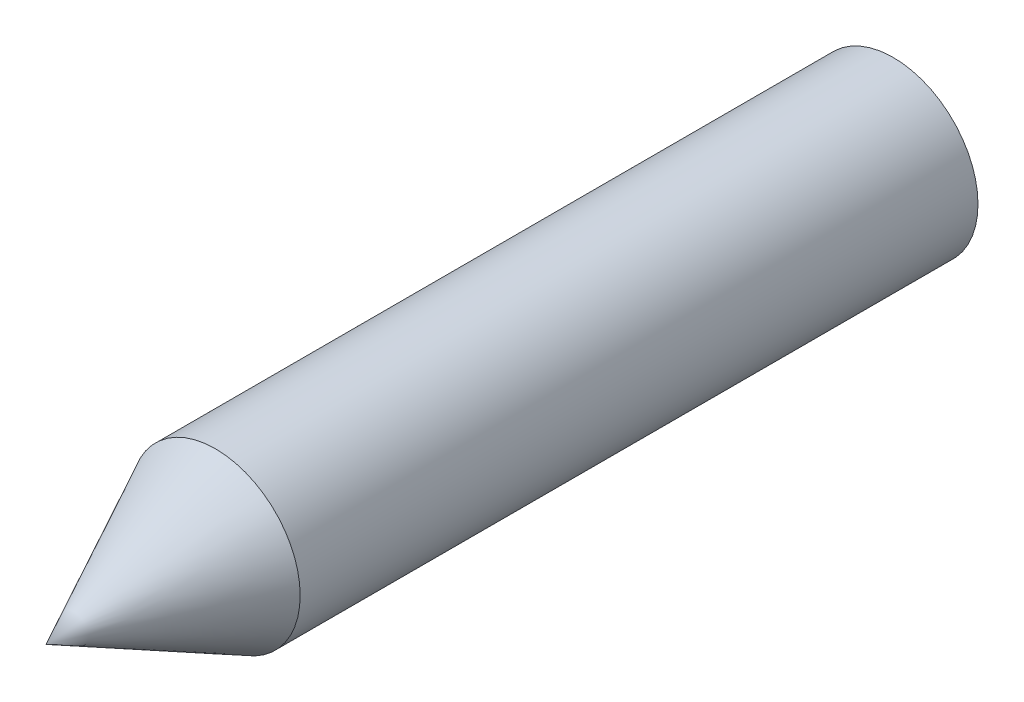
ISO-10303-21;
HEADER;
FILE_DESCRIPTION(('STEP AP214'),'2;1');
FILE_NAME('part.step','',(''),(''),'','','');
FILE_SCHEMA(('AUTOMOTIVE_DESIGN { 1 0 10303 214 1 1 1 1 }'));
ENDSEC;
DATA;
#1=APPLICATION_CONTEXT('core data for automotive mechanical design processes');
#2=APPLICATION_PROTOCOL_DEFINITION('international standard','automotive_design',2000,#1);
#3=PRODUCT_CONTEXT('',#1,'mechanical');
#4=PRODUCT('Part','Part','',(#3));
#5=PRODUCT_RELATED_PRODUCT_CATEGORY('part','',(#4));
#6=PRODUCT_DEFINITION_FORMATION('','',#4);
#7=PRODUCT_DEFINITION_CONTEXT('part definition',#1,'design');
#8=PRODUCT_DEFINITION('design','',#6,#7);
#9=PRODUCT_DEFINITION_SHAPE('','',#8);
#10=(LENGTH_UNIT() NAMED_UNIT(*) SI_UNIT(.MILLI.,.METRE.));
#11=(NAMED_UNIT(*) PLANE_ANGLE_UNIT() SI_UNIT($,.RADIAN.));
#12=(NAMED_UNIT(*) SI_UNIT($,.STERADIAN.) SOLID_ANGLE_UNIT());
#13=UNCERTAINTY_MEASURE_WITH_UNIT(LENGTH_MEASURE(1.E-05),#10,'distance_accuracy_value','');
#14=(GEOMETRIC_REPRESENTATION_CONTEXT(3) GLOBAL_UNCERTAINTY_ASSIGNED_CONTEXT((#13)) GLOBAL_UNIT_ASSIGNED_CONTEXT((#10,
#11,#12)) REPRESENTATION_CONTEXT('',''));
#15=CARTESIAN_POINT('',(0.,0.,0.));
#16=DIRECTION('',(0.,0.,1.));
#17=DIRECTION('',(1.,0.,0.));
#18=AXIS2_PLACEMENT_3D('',#15,#16,#17);
#19=CARTESIAN_POINT('',(0.,0.,40.));
#20=DIRECTION('',(0.,0.,-1.));
#21=DIRECTION('',(-1.,0.,0.));
#22=AXIS2_PLACEMENT_3D('',#19,#20,#21);
#23=CYLINDRICAL_SURFACE('',#22,5.);
#24=CARTESIAN_POINT('',(0.,0.,40.));
#25=DIRECTION('',(0.,0.,1.));
#26=DIRECTION('',(1.,0.,0.));
#27=AXIS2_PLACEMENT_3D('',#24,#25,#26);
#28=CIRCLE('',#27,5.);
#29=CARTESIAN_POINT('',(5.,0.,40.));
#30=VERTEX_POINT('',#29);
#31=EDGE_CURVE('E11',#30,#30,#28,.T.);
#32=ORIENTED_EDGE('',*,*,#31,.F.);
#33=EDGE_LOOP('',(#32));
#34=FACE_BOUND('',#33,.T.);
#35=CARTESIAN_POINT('',(0.,0.,0.));
#36=DIRECTION('',(0.,0.,1.));
#37=DIRECTION('',(1.,0.,0.));
#38=AXIS2_PLACEMENT_3D('',#35,#36,#37);
#39=CIRCLE('',#38,5.);
#40=CARTESIAN_POINT('',(5.,0.,0.));
#41=VERTEX_POINT('',#40);
#42=EDGE_CURVE('E36',#41,#41,#39,.T.);
#43=ORIENTED_EDGE('',*,*,#42,.T.);
#44=EDGE_LOOP('',(#43));
#45=FACE_BOUND('',#44,.T.);
#46=ADVANCED_FACE('F33',(#34,#45),#23,.T.);
#47=CARTESIAN_POINT('',(0.,0.,0.));
#48=DIRECTION('',(0.,0.,1.));
#49=DIRECTION('',(1.,0.,0.));
#50=AXIS2_PLACEMENT_3D('',#47,#48,#49);
#51=PLANE('',#50);
#52=ORIENTED_EDGE('',*,*,#42,.F.);
#53=EDGE_LOOP('',(#52));
#54=FACE_BOUND('',#53,.T.);
#55=ADVANCED_FACE('F45',(#54),#51,.F.);
#56=CARTESIAN_POINT('',(0.,0.,40.));
#57=DIRECTION('',(0.,0.,-1.));
#58=DIRECTION('',(-1.,0.,0.));
#59=AXIS2_PLACEMENT_3D('',#56,#57,#58);
#60=CONICAL_SURFACE('',#59,5.,0.463647609000806);
#61=CARTESIAN_POINT('',(0.,0.,50.));
#62=VERTEX_POINT('',#61);
#63=VERTEX_LOOP('',#62);
#64=FACE_BOUND('',#63,.T.);
#65=ORIENTED_EDGE('',*,*,#31,.T.);
#66=EDGE_LOOP('',(#65));
#67=FACE_BOUND('',#66,.T.);
#68=ADVANCED_FACE('F42',(#64,#67),#60,.T.);
#69=CLOSED_SHELL('',(#46,#55,#68));
#70=MANIFOLD_SOLID_BREP('B2',#69);
#71=ADVANCED_BREP_SHAPE_REPRESENTATION('',(#18,#70),#14);
#72=SHAPE_DEFINITION_REPRESENTATION(#9,#71);
ENDSEC;
END-ISO-10303-21;
